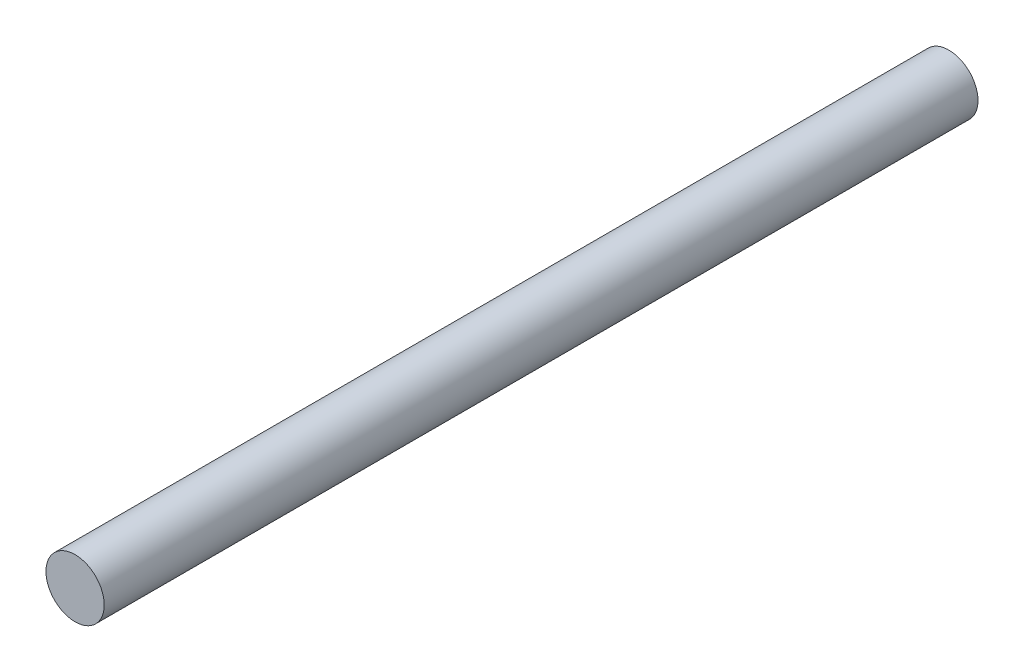
ISO-10303-21;
HEADER;
FILE_DESCRIPTION(('STEP AP214'),'2;1');
FILE_NAME('part.step','',(''),(''),'','','');
FILE_SCHEMA(('AUTOMOTIVE_DESIGN { 1 0 10303 214 1 1 1 1 }'));
ENDSEC;
DATA;
#1=APPLICATION_CONTEXT('core data for automotive mechanical design processes');
#2=APPLICATION_PROTOCOL_DEFINITION('international standard','automotive_design',2000,#1);
#3=PRODUCT_CONTEXT('',#1,'mechanical');
#4=PRODUCT('Part','Part','',(#3));
#5=PRODUCT_RELATED_PRODUCT_CATEGORY('part','',(#4));
#6=PRODUCT_DEFINITION_FORMATION('','',#4);
#7=PRODUCT_DEFINITION_CONTEXT('part definition',#1,'design');
#8=PRODUCT_DEFINITION('design','',#6,#7);
#9=PRODUCT_DEFINITION_SHAPE('','',#8);
#10=(LENGTH_UNIT() NAMED_UNIT(*) SI_UNIT(.MILLI.,.METRE.));
#11=(NAMED_UNIT(*) PLANE_ANGLE_UNIT() SI_UNIT($,.RADIAN.));
#12=(NAMED_UNIT(*) SI_UNIT($,.STERADIAN.) SOLID_ANGLE_UNIT());
#13=UNCERTAINTY_MEASURE_WITH_UNIT(LENGTH_MEASURE(1.E-05),#10,'distance_accuracy_value','');
#14=(GEOMETRIC_REPRESENTATION_CONTEXT(3) GLOBAL_UNCERTAINTY_ASSIGNED_CONTEXT((#13)) GLOBAL_UNIT_ASSIGNED_CONTEXT((#10,
#11,#12)) REPRESENTATION_CONTEXT('',''));
#15=CARTESIAN_POINT('',(0.,0.,0.));
#16=DIRECTION('',(0.,0.,1.));
#17=DIRECTION('',(1.,0.,0.));
#18=AXIS2_PLACEMENT_3D('',#15,#16,#17);
#19=CARTESIAN_POINT('',(0.,0.,0.));
#20=DIRECTION('',(0.,0.,1.));
#21=DIRECTION('',(1.,0.,0.));
#22=AXIS2_PLACEMENT_3D('',#19,#20,#21);
#23=CYLINDRICAL_SURFACE('',#22,3.99999999999999);
#24=CARTESIAN_POINT('',(0.,0.,0.));
#25=DIRECTION('',(0.,0.,1.));
#26=DIRECTION('',(1.,0.,0.));
#27=AXIS2_PLACEMENT_3D('',#24,#25,#26);
#28=CIRCLE('',#27,4.);
#29=CARTESIAN_POINT('',(4.,0.,0.));
#30=VERTEX_POINT('',#29);
#31=EDGE_CURVE('E10',#30,#30,#28,.T.);
#32=ORIENTED_EDGE('',*,*,#31,.T.);
#33=EDGE_LOOP('',(#32));
#34=FACE_BOUND('',#33,.T.);
#35=CARTESIAN_POINT('',(0.,0.,120.));
#36=DIRECTION('',(0.,0.,1.));
#37=DIRECTION('',(1.,0.,0.));
#38=AXIS2_PLACEMENT_3D('',#35,#36,#37);
#39=CIRCLE('',#38,3.99999999999998);
#40=CARTESIAN_POINT('',(4.,0.,120.));
#41=VERTEX_POINT('',#40);
#42=EDGE_CURVE('E37',#41,#41,#39,.T.);
#43=ORIENTED_EDGE('',*,*,#42,.F.);
#44=EDGE_LOOP('',(#43));
#45=FACE_BOUND('',#44,.T.);
#46=ADVANCED_FACE('F31',(#34,#45),#23,.T.);
#47=CARTESIAN_POINT('',(4.,0.,0.));
#48=DIRECTION('',(0.,0.,-1.));
#49=DIRECTION('',(-1.,0.,0.));
#50=AXIS2_PLACEMENT_3D('',#47,#48,#49);
#51=PLANE('',#50);
#52=ORIENTED_EDGE('',*,*,#31,.F.);
#53=EDGE_LOOP('',(#52));
#54=FACE_BOUND('',#53,.T.);
#55=ADVANCED_FACE('F46',(#54),#51,.T.);
#56=CARTESIAN_POINT('',(0.,0.,120.));
#57=DIRECTION('',(0.,0.,1.));
#58=DIRECTION('',(1.,0.,0.));
#59=AXIS2_PLACEMENT_3D('',#56,#57,#58);
#60=PLANE('',#59);
#61=ORIENTED_EDGE('',*,*,#42,.T.);
#62=EDGE_LOOP('',(#61));
#63=FACE_BOUND('',#62,.T.);
#64=ADVANCED_FACE('F43',(#63),#60,.T.);
#65=CLOSED_SHELL('',(#46,#55,#64));
#66=MANIFOLD_SOLID_BREP('B2',#65);
#67=ADVANCED_BREP_SHAPE_REPRESENTATION('',(#18,#66),#14);
#68=SHAPE_DEFINITION_REPRESENTATION(#9,#67);
ENDSEC;
END-ISO-10303-21;
